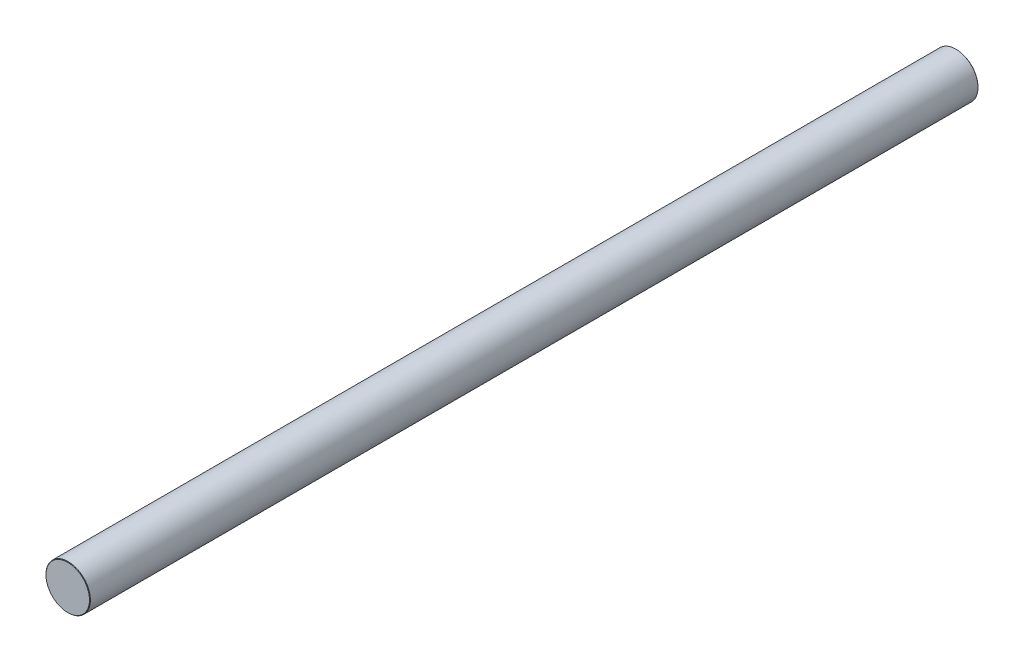
ISO-10303-21;
HEADER;
FILE_DESCRIPTION(('STEP AP214'),'2;1');
FILE_NAME('part.step','',(''),(''),'','','');
FILE_SCHEMA(('AUTOMOTIVE_DESIGN { 1 0 10303 214 1 1 1 1 }'));
ENDSEC;
DATA;
#1=APPLICATION_CONTEXT('core data for automotive mechanical design processes');
#2=APPLICATION_PROTOCOL_DEFINITION('international standard','automotive_design',2000,#1);
#3=PRODUCT_CONTEXT('',#1,'mechanical');
#4=PRODUCT('Part','Part','',(#3));
#5=PRODUCT_RELATED_PRODUCT_CATEGORY('part','',(#4));
#6=PRODUCT_DEFINITION_FORMATION('','',#4);
#7=PRODUCT_DEFINITION_CONTEXT('part definition',#1,'design');
#8=PRODUCT_DEFINITION('design','',#6,#7);
#9=PRODUCT_DEFINITION_SHAPE('','',#8);
#10=(LENGTH_UNIT() NAMED_UNIT(*) SI_UNIT(.MILLI.,.METRE.));
#11=(NAMED_UNIT(*) PLANE_ANGLE_UNIT() SI_UNIT($,.RADIAN.));
#12=(NAMED_UNIT(*) SI_UNIT($,.STERADIAN.) SOLID_ANGLE_UNIT());
#13=UNCERTAINTY_MEASURE_WITH_UNIT(LENGTH_MEASURE(1.E-05),#10,'distance_accuracy_value','');
#14=(GEOMETRIC_REPRESENTATION_CONTEXT(3) GLOBAL_UNCERTAINTY_ASSIGNED_CONTEXT((#13)) GLOBAL_UNIT_ASSIGNED_CONTEXT((#10,
#11,#12)) REPRESENTATION_CONTEXT('',''));
#15=CARTESIAN_POINT('',(0.,0.,0.));
#16=DIRECTION('',(0.,0.,1.));
#17=DIRECTION('',(1.,0.,0.));
#18=AXIS2_PLACEMENT_3D('',#15,#16,#17);
#19=CARTESIAN_POINT('',(0.,0.,200.));
#20=DIRECTION('',(0.,0.,-1.));
#21=DIRECTION('',(-1.,0.,0.));
#22=AXIS2_PLACEMENT_3D('',#19,#20,#21);
#23=CYLINDRICAL_SURFACE('',#22,5.);
#24=CARTESIAN_POINT('',(0.,0.,0.100000000000044));
#25=DIRECTION('',(0.,0.,1.));
#26=DIRECTION('',(1.,0.,0.));
#27=AXIS2_PLACEMENT_3D('',#24,#25,#26);
#28=CIRCLE('',#27,5.);
#29=CARTESIAN_POINT('',(5.,0.,0.100000000000044));
#30=VERTEX_POINT('',#29);
#31=EDGE_CURVE('E49',#30,#30,#28,.T.);
#32=ORIENTED_EDGE('',*,*,#31,.T.);
#33=EDGE_LOOP('',(#32));
#34=FACE_BOUND('',#33,.T.);
#35=CARTESIAN_POINT('',(0.,0.,199.9));
#36=DIRECTION('',(0.,0.,1.));
#37=DIRECTION('',(1.,0.,0.));
#38=AXIS2_PLACEMENT_3D('',#35,#36,#37);
#39=CIRCLE('',#38,5.);
#40=CARTESIAN_POINT('',(5.,0.,199.9));
#41=VERTEX_POINT('',#40);
#42=EDGE_CURVE('E53',#41,#41,#39,.F.);
#43=ORIENTED_EDGE('',*,*,#42,.T.);
#44=EDGE_LOOP('',(#43));
#45=FACE_BOUND('',#44,.T.);
#46=ADVANCED_FACE('F38',(#34,#45),#23,.T.);
#47=CARTESIAN_POINT('',(0.,0.,200.));
#48=DIRECTION('',(0.,0.,1.));
#49=DIRECTION('',(1.,0.,0.));
#50=AXIS2_PLACEMENT_3D('',#47,#48,#49);
#51=PLANE('',#50);
#52=CARTESIAN_POINT('',(0.,0.,200.));
#53=DIRECTION('',(0.,0.,1.));
#54=DIRECTION('',(1.,0.,0.));
#55=AXIS2_PLACEMENT_3D('',#52,#53,#54);
#56=CIRCLE('',#55,4.90000000000002);
#57=CARTESIAN_POINT('',(4.90000000000002,0.,200.));
#58=VERTEX_POINT('',#57);
#59=EDGE_CURVE('E10',#58,#58,#56,.T.);
#60=ORIENTED_EDGE('',*,*,#59,.T.);
#61=EDGE_LOOP('',(#60));
#62=FACE_BOUND('',#61,.T.);
#63=ADVANCED_FACE('F69',(#62),#51,.T.);
#64=CARTESIAN_POINT('',(0.,0.,0.));
#65=DIRECTION('',(0.,0.,1.));
#66=DIRECTION('',(1.,0.,0.));
#67=AXIS2_PLACEMENT_3D('',#64,#65,#66);
#68=PLANE('',#67);
#69=CARTESIAN_POINT('',(0.,0.,0.));
#70=DIRECTION('',(0.,0.,1.));
#71=DIRECTION('',(1.,0.,0.));
#72=AXIS2_PLACEMENT_3D('',#69,#70,#71);
#73=CIRCLE('',#72,4.89999999999996);
#74=CARTESIAN_POINT('',(4.89999999999996,0.,0.));
#75=VERTEX_POINT('',#74);
#76=EDGE_CURVE('E45',#75,#75,#73,.F.);
#77=ORIENTED_EDGE('',*,*,#76,.T.);
#78=EDGE_LOOP('',(#77));
#79=FACE_BOUND('',#78,.T.);
#80=ADVANCED_FACE('F66',(#79),#68,.F.);
#81=CARTESIAN_POINT('',(0.,0.,0.100000000000044));
#82=DIRECTION('',(0.,0.,1.));
#83=DIRECTION('',(1.,0.,0.));
#84=AXIS2_PLACEMENT_3D('',#81,#82,#83);
#85=CONICAL_SURFACE('',#84,5.,0.785398163397427);
#86=ORIENTED_EDGE('',*,*,#76,.F.);
#87=EDGE_LOOP('',(#86));
#88=FACE_BOUND('',#87,.T.);
#89=ORIENTED_EDGE('',*,*,#31,.F.);
#90=EDGE_LOOP('',(#89));
#91=FACE_BOUND('',#90,.T.);
#92=ADVANCED_FACE('F62',(#88,#91),#85,.T.);
#93=CARTESIAN_POINT('',(0.,0.,200.));
#94=DIRECTION('',(0.,0.,-1.));
#95=DIRECTION('',(-1.,0.,0.));
#96=AXIS2_PLACEMENT_3D('',#93,#94,#95);
#97=CONICAL_SURFACE('',#96,4.90000000000002,0.785398163397565);
#98=ORIENTED_EDGE('',*,*,#42,.F.);
#99=EDGE_LOOP('',(#98));
#100=FACE_BOUND('',#99,.T.);
#101=ORIENTED_EDGE('',*,*,#59,.F.);
#102=EDGE_LOOP('',(#101));
#103=FACE_BOUND('',#102,.T.);
#104=ADVANCED_FACE('F40',(#100,#103),#97,.T.);
#105=CLOSED_SHELL('',(#46,#63,#80,#92,#104));
#106=MANIFOLD_SOLID_BREP('B2',#105);
#107=ADVANCED_BREP_SHAPE_REPRESENTATION('',(#18,#106),#14);
#108=SHAPE_DEFINITION_REPRESENTATION(#9,#107);
ENDSEC;
END-ISO-10303-21;
